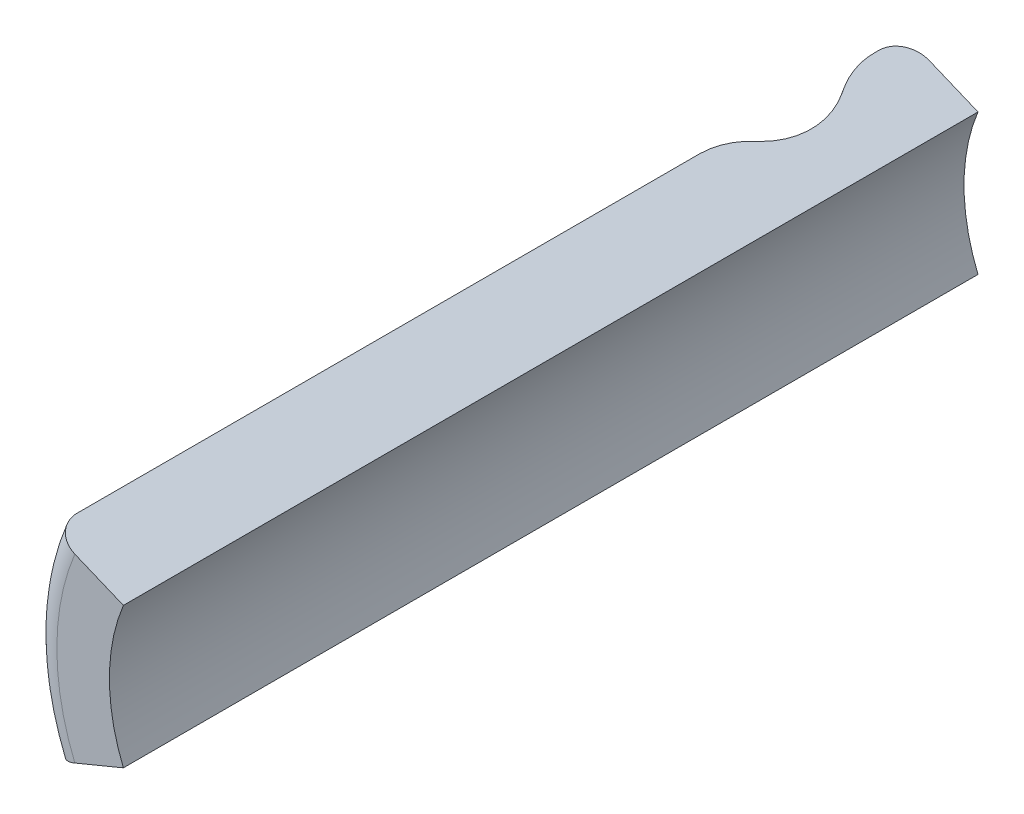
ISO-10303-21;
HEADER;
FILE_DESCRIPTION(('STEP AP214'),'2;1');
FILE_NAME('part.step','',(''),(''),'','','');
FILE_SCHEMA(('AUTOMOTIVE_DESIGN { 1 0 10303 214 1 1 1 1 }'));
ENDSEC;
DATA;
#1=APPLICATION_CONTEXT('core data for automotive mechanical design processes');
#2=APPLICATION_PROTOCOL_DEFINITION('international standard','automotive_design',2000,#1);
#3=PRODUCT_CONTEXT('',#1,'mechanical');
#4=PRODUCT('Part','Part','',(#3));
#5=PRODUCT_RELATED_PRODUCT_CATEGORY('part','',(#4));
#6=PRODUCT_DEFINITION_FORMATION('','',#4);
#7=PRODUCT_DEFINITION_CONTEXT('part definition',#1,'design');
#8=PRODUCT_DEFINITION('design','',#6,#7);
#9=PRODUCT_DEFINITION_SHAPE('','',#8);
#10=(LENGTH_UNIT() NAMED_UNIT(*) SI_UNIT(.MILLI.,.METRE.));
#11=(NAMED_UNIT(*) PLANE_ANGLE_UNIT() SI_UNIT($,.RADIAN.));
#12=(NAMED_UNIT(*) SI_UNIT($,.STERADIAN.) SOLID_ANGLE_UNIT());
#13=UNCERTAINTY_MEASURE_WITH_UNIT(LENGTH_MEASURE(1.E-05),#10,'distance_accuracy_value','');
#14=(GEOMETRIC_REPRESENTATION_CONTEXT(3) GLOBAL_UNCERTAINTY_ASSIGNED_CONTEXT((#13)) GLOBAL_UNIT_ASSIGNED_CONTEXT((#10,
#11,#12)) REPRESENTATION_CONTEXT('',''));
#15=CARTESIAN_POINT('',(0.,0.,0.));
#16=DIRECTION('',(0.,0.,1.));
#17=DIRECTION('',(1.,0.,0.));
#18=AXIS2_PLACEMENT_3D('',#15,#16,#17);
#19=CARTESIAN_POINT('',(0.,0.,0.42));
#20=DIRECTION('',(0.,0.,1.));
#21=DIRECTION('',(1.,0.,0.));
#22=AXIS2_PLACEMENT_3D('',#19,#20,#21);
#23=CYLINDRICAL_SURFACE('',#22,5.25);
#24=DIRECTION('',(0.,0.,1.));
#25=VECTOR('',#24,1.);
#26=CARTESIAN_POINT('',(-4.85036754568425,2.00908801991673,0.42));
#27=LINE('',#26,#25);
#28=CARTESIAN_POINT('',(-4.85036754568425,2.00908801991674,1.03375025520622));
#29=VERTEX_POINT('',#28);
#30=CARTESIAN_POINT('',(-4.85036754568425,2.00908801991674,0.945));
#31=VERTEX_POINT('',#30);
#32=EDGE_CURVE('E102',#29,#31,#27,.F.);
#33=ORIENTED_EDGE('',*,*,#32,.T.);
#34=CARTESIAN_POINT('',(0.,0.,0.945));
#35=DIRECTION('',(0.,0.,1.));
#36=DIRECTION('',(1.,0.,0.));
#37=AXIS2_PLACEMENT_3D('',#34,#35,#36);
#38=CIRCLE('',#37,5.25);
#39=CARTESIAN_POINT('',(-4.85036754568426,-2.00908801991672,0.945));
#40=VERTEX_POINT('',#39);
#41=EDGE_CURVE('E118',#40,#31,#38,.F.);
#42=ORIENTED_EDGE('',*,*,#41,.F.);
#43=DIRECTION('',(0.,0.,1.));
#44=VECTOR('',#43,1.);
#45=CARTESIAN_POINT('',(-4.85036754568425,-2.00908801991673,0.42));
#46=LINE('',#45,#44);
#47=CARTESIAN_POINT('',(-4.85036754568426,-2.00908801991672,1.03375025520622));
#48=VERTEX_POINT('',#47);
#49=EDGE_CURVE('E108',#40,#48,#46,.T.);
#50=ORIENTED_EDGE('',*,*,#49,.T.);
#51=CARTESIAN_POINT('',(0.,0.,1.03375025520622));
#52=DIRECTION('',(0.,0.,-1.));
#53=DIRECTION('',(1.,0.,0.));
#54=AXIS2_PLACEMENT_3D('',#51,#52,#53);
#55=CIRCLE('',#54,5.25);
#56=EDGE_CURVE('E159',#29,#48,#55,.F.);
#57=ORIENTED_EDGE('',*,*,#56,.F.);
#58=EDGE_LOOP('',(#33,#42,#50,#57));
#59=FACE_BOUND('',#58,.T.);
#60=ADVANCED_FACE('F17',(#59),#23,.T.);
#61=CARTESIAN_POINT('',(0.,0.,0.945));
#62=DIRECTION('',(0.,0.,1.));
#63=DIRECTION('',(1.,0.,0.));
#64=AXIS2_PLACEMENT_3D('',#61,#62,#63);
#65=TOROIDAL_SURFACE('',#64,4.725,0.525);
#66=CARTESIAN_POINT('',(-4.85036754568425,2.00908801991674,0.945));
#67=CARTESIAN_POINT('',(-4.85039072116,2.00909761951311,0.915464391405059));
#68=CARTESIAN_POINT('',(-4.84806622229641,2.00813478055809,0.885936277537769));
#69=CARTESIAN_POINT('',(-4.83889289537985,2.00433506413717,0.827737923886833));
#70=CARTESIAN_POINT('',(-4.83204761711793,2.00149965704287,0.799067029448648));
#71=CARTESIAN_POINT('',(-4.81399892411025,1.99402364361598,0.743363719677459));
#72=CARTESIAN_POINT('',(-4.80279341672495,1.98938217048371,0.716332098305047));
#73=CARTESIAN_POINT('',(-4.7763521295304,1.97842983072113,0.664693094464665));
#74=CARTESIAN_POINT('',(-4.7611170597048,1.97211925817567,0.640085285983271));
#75=CARTESIAN_POINT('',(-4.72704476589314,1.95800605197771,0.593985045585102));
#76=CARTESIAN_POINT('',(-4.70820719582775,1.95020327497447,0.572492913329231));
#77=CARTESIAN_POINT('',(-4.66746560106758,1.9333275538721,0.533237078711864));
#78=CARTESIAN_POINT('',(-4.64556162580988,1.92425463025048,0.515473316252535));
#79=CARTESIAN_POINT('',(-4.59930486040363,1.9050944506677,0.484173774991626));
#80=CARTESIAN_POINT('',(-4.57495133392577,1.89500688970896,0.470639272546676));
#81=CARTESIAN_POINT('',(-4.52449545169202,1.87410737898624,0.448194865945521));
#82=CARTESIAN_POINT('',(-4.4983941303668,1.86329585769747,0.43928225317132));
#83=CARTESIAN_POINT('',(-4.45433269969835,1.84504501553704,0.4285495531201));
#84=CARTESIAN_POINT('',(-4.43664976944948,1.83772050600546,0.425345407947885));
#85=CARTESIAN_POINT('',(-4.40109062734294,1.82299142707858,0.421070913483755));
#86=CARTESIAN_POINT('',(-4.38321472577347,1.81558698620886,0.419997539157893));
#87=CARTESIAN_POINT('',(-4.36533079111583,1.80817921792507,0.42));
#88=B_SPLINE_CURVE_WITH_KNOTS('',3,(#66,#67,#68,#69,#70,#71,#72,#73,#74,#75,#76,#77,#78,#79,#80,
#81,#82,#83,#84,#85,#86,#87),.UNSPECIFIED.,.F.,.F.,(4,2,2,2,2,2,2,2,2,2,4),(0.,
0.0884891143575643,0.176908828074504,0.265371030215084,0.353817656241404,0.44227278329125,
0.530726484417661,0.619206854434947,0.707635312539519,0.765743495319773,0.823769123330236),.UNSPECIFIED.);
#89=CARTESIAN_POINT('',(-4.36533079111583,1.80817921792506,0.420000000000001));
#90=VERTEX_POINT('',#89);
#91=EDGE_CURVE('E121',#31,#90,#88,.T.);
#92=ORIENTED_EDGE('',*,*,#91,.T.);
#93=CARTESIAN_POINT('',(0.,0.,0.42));
#94=DIRECTION('',(0.,0.,1.));
#95=DIRECTION('',(-0.923879532511286,0.382683432365091,0.));
#96=AXIS2_PLACEMENT_3D('',#93,#94,#95);
#97=CIRCLE('',#96,4.725);
#98=CARTESIAN_POINT('',(-4.36533079111583,-1.80817921792505,0.420000000000001));
#99=VERTEX_POINT('',#98);
#100=EDGE_CURVE('E125',#90,#99,#97,.T.);
#101=ORIENTED_EDGE('',*,*,#100,.T.);
#102=CARTESIAN_POINT('',(-4.36533079111584,-1.80817921792503,0.42));
#103=CARTESIAN_POINT('',(-4.39261813537697,-1.81948200599914,0.419974915045805));
#104=CARTESIAN_POINT('',(-4.41989855541262,-1.83078192596514,0.42249093448535));
#105=CARTESIAN_POINT('',(-4.47366682317657,-1.85305347169828,0.432420071990568));
#106=CARTESIAN_POINT('',(-4.5001552757268,-1.86402534799086,0.439829347790094));
#107=CARTESIAN_POINT('',(-4.55161842351754,-1.88534208176819,0.459365112327078));
#108=CARTESIAN_POINT('',(-4.57659238523411,-1.89568663541738,0.471493866121253));
#109=CARTESIAN_POINT('',(-4.62430060396151,-1.91544802665093,0.500113709146319));
#110=CARTESIAN_POINT('',(-4.64703525455742,-1.92486502726358,0.51660402989646));
#111=CARTESIAN_POINT('',(-4.68962632310514,-1.942506825492,0.553483614964273));
#112=CARTESIAN_POINT('',(-4.70948246420637,-1.95073150843252,0.573873253875513));
#113=CARTESIAN_POINT('',(-4.745750126341,-1.96575406596425,0.617971638271389));
#114=CARTESIAN_POINT('',(-4.76216170289757,-1.97255196355391,0.641680330245724));
#115=CARTESIAN_POINT('',(-4.79107870844551,-1.98452977943509,0.691748292332198));
#116=CARTESIAN_POINT('',(-4.80358295823713,-1.98970920928607,0.718108359441452));
#117=CARTESIAN_POINT('',(-4.8243188861153,-1.9982983118416,0.772721412830139));
#118=CARTESIAN_POINT('',(-4.83255306663858,-2.00170902108937,0.800973279449886));
#119=CARTESIAN_POINT('',(-4.84246878854448,-2.00581624758352,0.848665028339134));
#120=CARTESIAN_POINT('',(-4.84542903268829,-2.00704242085582,0.867804894118826));
#121=CARTESIAN_POINT('',(-4.84937815063553,-2.00867819906897,0.906293832184033));
#122=CARTESIAN_POINT('',(-4.85036981920592,-2.00908896164021,0.925642568616027));
#123=CARTESIAN_POINT('',(-4.85036754568426,-2.00908801991671,0.944999999999993));
#124=B_SPLINE_CURVE_WITH_KNOTS('',3,(#102,#103,#104,#105,#106,#107,#108,#109,#110,#111,#112,
#113,#114,#115,#116,#117,#118,#119,#120,#121,#122,#123),.UNSPECIFIED.,.F.,.F.,(4,2,2,2,2,2,2,2,
2,2,4),(0.,0.0884891143575647,0.176908828074505,0.265371030215086,0.353817656241405,
0.442272783291251,0.530726484417661,0.619206854434947,0.707635312539521,0.765743495319775,
0.823769123330237),.UNSPECIFIED.);
#125=EDGE_CURVE('E111',#99,#40,#124,.T.);
#126=ORIENTED_EDGE('',*,*,#125,.T.);
#127=ORIENTED_EDGE('',*,*,#41,.T.);
#128=EDGE_LOOP('',(#92,#101,#126,#127));
#129=FACE_BOUND('',#128,.T.);
#130=ADVANCED_FACE('F123',(#129),#65,.T.);
#131=CARTESIAN_POINT('',(0.,0.,1.03375025520622));
#132=DIRECTION('',(0.,0.,-1.));
#133=DIRECTION('',(1.,0.,0.));
#134=AXIS2_PLACEMENT_3D('',#131,#132,#133);
#135=TOROIDAL_SURFACE('',#134,3.675,1.575);
#136=CARTESIAN_POINT('',(-4.64300403924538,1.92319524320852,1.84408106999119));
#137=CARTESIAN_POINT('',(-4.66429309803461,1.93201346008917,1.80567264401998));
#138=CARTESIAN_POINT('',(-4.68405717686005,1.94020000958649,1.76630490990075));
#139=CARTESIAN_POINT('',(-4.72042309677667,1.95526326682412,1.6858823007901));
#140=CARTESIAN_POINT('',(-4.73702417511881,1.96213965862346,1.64482702174626));
#141=CARTESIAN_POINT('',(-4.7812053319323,1.98044009297694,1.52144596810938));
#142=CARTESIAN_POINT('',(-4.80415967611241,1.98994809365172,1.43709672179313));
#143=CARTESIAN_POINT('',(-4.83034396301637,2.00079398040841,1.29949087476993));
#144=CARTESIAN_POINT('',(-4.83778357186358,2.00387556729167,1.24711280321494));
#145=CARTESIAN_POINT('',(-4.84782961323938,2.00803677387769,1.14108991509352));
#146=CARTESIAN_POINT('',(-4.85036834746839,2.00908835202661,1.0874375779001));
#147=CARTESIAN_POINT('',(-4.85036754568425,2.00908801991674,1.03375025520622));
#148=B_SPLINE_CURVE_WITH_KNOTS('',3,(#136,#137,#138,#139,#140,#141,#142,#143,#144,#145,#146,
#147),.UNSPECIFIED.,.F.,.F.,(4,2,2,2,2,4),(0.,0.134277866281093,0.268588072437484,
0.530970445713373,0.689715228991273,0.850637571574639),.UNSPECIFIED.);
#149=CARTESIAN_POINT('',(-4.64300403923459,1.92319524320823,1.8440810699835));
#150=VERTEX_POINT('',#149);
#151=EDGE_CURVE('E166',#150,#29,#148,.T.);
#152=ORIENTED_EDGE('',*,*,#151,.T.);
#153=ORIENTED_EDGE('',*,*,#56,.T.);
#154=CARTESIAN_POINT('',(-4.85036754568426,-2.0090880199167,1.03375025520622));
#155=CARTESIAN_POINT('',(-4.85036600529361,-2.00908738186601,1.07854079166083));
#156=CARTESIAN_POINT('',(-4.84860081541753,-2.00835621627917,1.1233046877799));
#157=CARTESIAN_POINT('',(-4.8415568869684,-2.00543852558316,1.21251818484822));
#158=CARTESIAN_POINT('',(-4.83627730228437,-2.00325165000333,1.25696770750516));
#159=CARTESIAN_POINT('',(-4.81551535662384,-1.99465177052949,1.38736996437549));
#160=CARTESIAN_POINT('',(-4.79510464015692,-1.98619737495114,1.4724818037188));
#161=CARTESIAN_POINT('',(-4.75214900498003,-1.96840456828052,1.60505951192238));
#162=CARTESIAN_POINT('',(-4.73363143829542,-1.96073434101761,1.65411635318998));
#163=CARTESIAN_POINT('',(-4.69184976586033,-1.94342780563636,1.75062473145222));
#164=CARTESIAN_POINT('',(-4.66852403450147,-1.93376597135525,1.79804501708299));
#165=CARTESIAN_POINT('',(-4.64300403924539,-1.92319524320849,1.84408106999119));
#166=B_SPLINE_CURVE_WITH_KNOTS('',3,(#154,#155,#156,#157,#158,#159,#160,#161,#162,#163,#164,
#165),.UNSPECIFIED.,.F.,.F.,(4,2,2,2,2,4),(0.,0.134277866281094,0.268588072437484,
0.530970445713373,0.689715228991272,0.850637571574638),.UNSPECIFIED.);
#167=CARTESIAN_POINT('',(-4.64300403923459,-1.92319524320821,1.8440810699835));
#168=VERTEX_POINT('',#167);
#169=EDGE_CURVE('E114',#48,#168,#166,.T.);
#170=ORIENTED_EDGE('',*,*,#169,.T.);
#171=CARTESIAN_POINT('',(0.,0.,1.8440810699758));
#172=DIRECTION('',(0.,0.,-1.));
#173=DIRECTION('',(-1.,0.,0.));
#174=AXIS2_PLACEMENT_3D('',#171,#172,#173);
#175=CIRCLE('',#174,5.02555135801686);
#176=EDGE_CURVE('E155',#150,#168,#175,.F.);
#177=ORIENTED_EDGE('',*,*,#176,.F.);
#178=EDGE_LOOP('',(#152,#153,#170,#177));
#179=FACE_BOUND('',#178,.T.);
#180=ADVANCED_FACE('F146',(#179),#135,.T.);
#181=CARTESIAN_POINT('',(0.,0.,0.42));
#182=DIRECTION('',(0.,0.,1.));
#183=DIRECTION('',(1.,0.,0.));
#184=AXIS2_PLACEMENT_3D('',#181,#182,#183);
#185=PLANE('',#184);
#186=ORIENTED_EDGE('',*,*,#100,.F.);
#187=DIRECTION('',(-0.923879532511288,0.382683432365087,0.));
#188=VECTOR('',#187,1.);
#189=CARTESIAN_POINT('',(-3.39525728197898,1.40636161394171,0.42));
#190=LINE('',#189,#188);
#191=CARTESIAN_POINT('',(-3.39525728197898,1.40636161394172,0.420000000000001));
#192=VERTEX_POINT('',#191);
#193=EDGE_CURVE('E165',#192,#90,#190,.T.);
#194=ORIENTED_EDGE('',*,*,#193,.F.);
#195=CARTESIAN_POINT('',(0.,0.,0.420000000000001));
#196=DIRECTION('',(0.,0.,1.));
#197=DIRECTION('',(1.,0.,0.));
#198=AXIS2_PLACEMENT_3D('',#195,#196,#197);
#199=CIRCLE('',#198,3.675);
#200=CARTESIAN_POINT('',(-3.39525728197898,-1.4063616139417,0.420000000000001));
#201=VERTEX_POINT('',#200);
#202=EDGE_CURVE('E287',#192,#201,#199,.T.);
#203=ORIENTED_EDGE('',*,*,#202,.T.);
#204=DIRECTION('',(0.923879532511288,0.382683432365087,0.));
#205=VECTOR('',#204,1.);
#206=CARTESIAN_POINT('',(-4.36533079111583,-1.80817921792505,0.42));
#207=LINE('',#206,#205);
#208=EDGE_CURVE('E241',#99,#201,#207,.T.);
#209=ORIENTED_EDGE('',*,*,#208,.F.);
#210=EDGE_LOOP('',(#186,#194,#203,#209));
#211=FACE_BOUND('',#210,.T.);
#212=ADVANCED_FACE('F250',(#211),#185,.F.);
#213=CARTESIAN_POINT('',(0.,0.,1.8440810699758));
#214=DIRECTION('',(0.,0.,-1.));
#215=DIRECTION('',(-1.,0.,0.));
#216=AXIS2_PLACEMENT_3D('',#213,#214,#215);
#217=CONICAL_SURFACE('',#216,5.02555135801686,0.540419500335847);
#218=DIRECTION('',(0.475332098003424,-0.196889001624276,0.857492925712544));
#219=VECTOR('',#218,1.);
#220=CARTESIAN_POINT('',(-276615.197263172,114577.766264916,-499000.));
#221=LINE('',#220,#219);
#222=CARTESIAN_POINT('',(-4.57200124642326,1.89378492346583,1.97216918519791));
#223=VERTEX_POINT('',#222);
#224=EDGE_CURVE('E240',#223,#150,#221,.F.);
#225=ORIENTED_EDGE('',*,*,#224,.T.);
#226=ORIENTED_EDGE('',*,*,#176,.T.);
#227=DIRECTION('',(0.475332098003424,0.196889001624276,0.857492925712544));
#228=VECTOR('',#227,1.);
#229=CARTESIAN_POINT('',(-276615.197263172,-114577.766264915,-499000.));
#230=LINE('',#229,#228);
#231=CARTESIAN_POINT('',(-4.57200124642326,-1.8937849234587,1.97216918519791));
#232=VERTEX_POINT('',#231);
#233=EDGE_CURVE('E238',#168,#232,#230,.T.);
#234=ORIENTED_EDGE('',*,*,#233,.T.);
#235=CARTESIAN_POINT('',(0.,0.,1.97216918520165));
#236=DIRECTION('',(0.,0.,-1.));
#237=DIRECTION('',(1.,0.,0.));
#238=AXIS2_PLACEMENT_3D('',#235,#236,#237);
#239=CIRCLE('',#238,4.94869848887901);
#240=EDGE_CURVE('E307',#232,#223,#239,.T.);
#241=ORIENTED_EDGE('',*,*,#240,.T.);
#242=EDGE_LOOP('',(#225,#226,#234,#241));
#243=FACE_BOUND('',#242,.T.);
#244=ADVANCED_FACE('F259',(#243),#217,.T.);
#245=CARTESIAN_POINT('',(0.,0.,17.5));
#246=DIRECTION('',(0.,0.,1.));
#247=DIRECTION('',(1.,0.,0.));
#248=AXIS2_PLACEMENT_3D('',#245,#246,#247);
#249=PLANE('',#248);
#250=DIRECTION('',(-0.923879532511288,0.382683432365087,0.));
#251=VECTOR('',#250,1.);
#252=CARTESIAN_POINT('',(-3.39525728197898,1.40636161394171,17.5));
#253=LINE('',#252,#251);
#254=CARTESIAN_POINT('',(-3.39525728197898,1.40636161394172,17.5));
#255=VERTEX_POINT('',#254);
#256=CARTESIAN_POINT('',(-4.36533079111583,1.80817921792505,17.5));
#257=VERTEX_POINT('',#256);
#258=EDGE_CURVE('E277',#255,#257,#253,.T.);
#259=ORIENTED_EDGE('',*,*,#258,.T.);
#260=CARTESIAN_POINT('',(0.,0.,17.5));
#261=DIRECTION('',(0.,0.,-1.));
#262=DIRECTION('',(-0.923879532511286,-0.382683432365092,0.));
#263=AXIS2_PLACEMENT_3D('',#260,#261,#262);
#264=CIRCLE('',#263,4.725);
#265=CARTESIAN_POINT('',(-4.36533079111583,-1.80817921792505,17.5));
#266=VERTEX_POINT('',#265);
#267=EDGE_CURVE('E346',#266,#257,#264,.T.);
#268=ORIENTED_EDGE('',*,*,#267,.F.);
#269=DIRECTION('',(-0.923879532511286,-0.382683432365091,0.));
#270=VECTOR('',#269,1.);
#271=CARTESIAN_POINT('',(-14.7629551057445,-6.1150162255045,17.5));
#272=LINE('',#271,#270);
#273=CARTESIAN_POINT('',(-3.39525728197899,-1.40636161394169,17.5));
#274=VERTEX_POINT('',#273);
#275=EDGE_CURVE('E237',#266,#274,#272,.F.);
#276=ORIENTED_EDGE('',*,*,#275,.T.);
#277=CARTESIAN_POINT('',(0.,0.,17.5));
#278=DIRECTION('',(0.,0.,1.));
#279=DIRECTION('',(1.,0.,0.));
#280=AXIS2_PLACEMENT_3D('',#277,#278,#279);
#281=CIRCLE('',#280,3.675);
#282=EDGE_CURVE('E284',#274,#255,#281,.F.);
#283=ORIENTED_EDGE('',*,*,#282,.T.);
#284=EDGE_LOOP('',(#259,#268,#276,#283));
#285=FACE_BOUND('',#284,.T.);
#286=ADVANCED_FACE('F262',(#285),#249,.T.);
#287=CARTESIAN_POINT('',(0.,0.,-5.13241922552691));
#288=DIRECTION('',(0.,0.,1.));
#289=DIRECTION('',(1.,0.,0.));
#290=AXIS2_PLACEMENT_3D('',#287,#288,#289);
#291=CYLINDRICAL_SURFACE('',#290,3.675);
#292=ORIENTED_EDGE('',*,*,#202,.F.);
#293=DIRECTION('',(0.,0.,1.));
#294=VECTOR('',#293,1.);
#295=CARTESIAN_POINT('',(-3.39525728197898,1.40636161394172,-69.0547595456195));
#296=LINE('',#295,#294);
#297=EDGE_CURVE('E352',#192,#255,#296,.T.);
#298=ORIENTED_EDGE('',*,*,#297,.T.);
#299=ORIENTED_EDGE('',*,*,#282,.F.);
#300=DIRECTION('',(0.,0.,1.));
#301=VECTOR('',#300,1.);
#302=CARTESIAN_POINT('',(-3.39525728197899,-1.40636161394169,-69.0547595456195));
#303=LINE('',#302,#301);
#304=EDGE_CURVE('E228',#274,#201,#303,.F.);
#305=ORIENTED_EDGE('',*,*,#304,.T.);
#306=EDGE_LOOP('',(#292,#298,#299,#305));
#307=FACE_BOUND('',#306,.T.);
#308=ADVANCED_FACE('F267',(#307),#291,.F.);
#309=CARTESIAN_POINT('',(0.,0.,2.7825));
#310=DIRECTION('',(0.,0.,-1.));
#311=DIRECTION('',(1.,0.,0.));
#312=AXIS2_PLACEMENT_3D('',#309,#310,#311);
#313=TOROIDAL_SURFACE('',#312,6.29924984687627,1.575);
#314=CARTESIAN_POINT('',(0.,0.,3.59283081479589));
#315=DIRECTION('',(0.,0.,1.));
#316=DIRECTION('',(-1.,0.,0.));
#317=AXIS2_PLACEMENT_3D('',#314,#315,#316);
#318=CIRCLE('',#317,4.94869848887447);
#319=CARTESIAN_POINT('',(-4.57200124644275,1.8937849234633,3.59283081479712));
#320=VERTEX_POINT('',#319);
#321=CARTESIAN_POINT('',(-4.57200124644391,-1.89378492346374,3.59283081479665));
#322=VERTEX_POINT('',#321);
#323=EDGE_CURVE('E314',#320,#322,#318,.T.);
#324=ORIENTED_EDGE('',*,*,#323,.F.);
#325=CARTESIAN_POINT('',(-4.57200124644432,1.89378492346395,3.5928308147974));
#326=CARTESIAN_POINT('',(-4.55093515448217,1.88505906246703,3.55482724904515));
#327=CARTESIAN_POINT('',(-4.53136157275591,1.8769514194518,3.51587916441505));
#328=CARTESIAN_POINT('',(-4.49531475325361,1.86202033793353,3.43633928581823));
#329=CARTESIAN_POINT('',(-4.47884136811824,1.85519683839226,3.39574757008851));
#330=CARTESIAN_POINT('',(-4.43430005042164,1.83674722051636,3.27203149845141));
#331=CARTESIAN_POINT('',(-4.41102736952862,1.8271073604577,3.18681508065259));
#332=CARTESIAN_POINT('',(-4.37802955209979,1.81343921694996,3.01337536711703));
#333=CARTESIAN_POINT('',(-4.36830948583724,1.80941303367685,2.92515095867636));
#334=CARTESIAN_POINT('',(-4.36268631730648,1.8070838410079,2.74814278282857));
#335=CARTESIAN_POINT('',(-4.36678806541627,1.80878284070441,2.65935882997643));
#336=CARTESIAN_POINT('',(-4.38870850344873,1.81786258343062,2.4837431147338));
#337=CARTESIAN_POINT('',(-4.40653744544026,1.82524757300627,2.39691286135823));
#338=CARTESIAN_POINT('',(-4.45540445468333,1.84548895098736,2.22785223157007));
#339=CARTESIAN_POINT('',(-4.48641809571375,1.85833522172073,2.14561366566707));
#340=CARTESIAN_POINT('',(-4.53868306572915,1.87998408113813,2.03467500151676));
#341=CARTESIAN_POINT('',(-4.55485093830133,1.88668103323225,2.00309135114615));
#342=CARTESIAN_POINT('',(-4.57200124644325,1.89378492346351,1.97216918520453));
#343=B_SPLINE_CURVE_WITH_KNOTS('',3,(#325,#326,#327,#328,#329,#330,#331,#332,#333,#334,#335,
#336,#337,#338,#339,#340,#341,#342),.UNSPECIFIED.,.F.,.F.,(4,2,2,2,2,2,2,2,4),(0.,
0.132875919697835,0.265745521907456,0.530963010608872,0.796279695273054,1.06168949507938,
1.32729770703766,1.5924159779919,1.70064738321001),.UNSPECIFIED.);
#344=EDGE_CURVE('E193',#320,#223,#343,.T.);
#345=ORIENTED_EDGE('',*,*,#344,.T.);
#346=ORIENTED_EDGE('',*,*,#240,.F.);
#347=CARTESIAN_POINT('',(-4.57200124644293,-1.89378492346333,1.97216918520513));
#348=CARTESIAN_POINT('',(-4.55093515448085,-1.88505906246644,2.01017275095742));
#349=CARTESIAN_POINT('',(-4.53136157275465,-1.87695141945123,2.04912083558757));
#350=CARTESIAN_POINT('',(-4.49531475325249,-1.86202033793303,2.12866071418446));
#351=CARTESIAN_POINT('',(-4.47884136811719,-1.85519683839179,2.16925242991421));
#352=CARTESIAN_POINT('',(-4.4343000504208,-1.83674722051598,2.29296850155141));
#353=CARTESIAN_POINT('',(-4.41102736952794,-1.82710736045737,2.37818491935027));
#354=CARTESIAN_POINT('',(-4.3780295520994,-1.81343921694976,2.55162463288591));
#355=CARTESIAN_POINT('',(-4.36830948583701,-1.80941303367671,2.63984904132659));
#356=CARTESIAN_POINT('',(-4.36268631730655,-1.80708384100789,2.81685721717439));
#357=CARTESIAN_POINT('',(-4.3667880654165,-1.80878284070446,2.90564117002653));
#358=CARTESIAN_POINT('',(-4.38870850344926,-1.81786258343079,3.08125688526911));
#359=CARTESIAN_POINT('',(-4.40653744544094,-1.82524757300651,3.16808713864464));
#360=CARTESIAN_POINT('',(-4.45540445468431,-1.84548895098772,3.33714776843271));
#361=CARTESIAN_POINT('',(-4.48641809571487,-1.85833522172116,3.41938633433564));
#362=CARTESIAN_POINT('',(-4.53868306573036,-1.8799840811386,3.53032499848564));
#363=CARTESIAN_POINT('',(-4.55485093830248,-1.88668103323269,3.56190864885601));
#364=CARTESIAN_POINT('',(-4.57200124644433,-1.89378492346392,3.5928308147974));
#365=B_SPLINE_CURVE_WITH_KNOTS('',3,(#347,#348,#349,#350,#351,#352,#353,#354,#355,#356,#357,
#358,#359,#360,#361,#362,#363,#364),.UNSPECIFIED.,.F.,.F.,(4,2,2,2,2,2,2,2,4),(0.,
0.132875919697836,0.265745521907457,0.530963010608873,0.796279695273056,1.06168949507938,
1.32729770703766,1.59241597799191,1.70064738320931),.UNSPECIFIED.);
#366=EDGE_CURVE('E308',#232,#322,#365,.T.);
#367=ORIENTED_EDGE('',*,*,#366,.T.);
#368=EDGE_LOOP('',(#324,#345,#346,#367));
#369=FACE_BOUND('',#368,.T.);
#370=ADVANCED_FACE('F320',(#369),#313,.F.);
#371=CARTESIAN_POINT('',(0.,0.,3.72091893001425));
#372=DIRECTION('',(0.,0.,1.));
#373=DIRECTION('',(0.,-1.,0.));
#374=AXIS2_PLACEMENT_3D('',#371,#372,#373);
#375=CONICAL_SURFACE('',#374,5.02555135801686,0.540419500335847);
#376=DIRECTION('',(0.475332098003445,-0.196889001624286,-0.85749292571253));
#377=VECTOR('',#376,1.);
#378=CARTESIAN_POINT('',(-4.64300403923796,1.92319524320545,3.72091892999543));
#379=LINE('',#378,#377);
#380=CARTESIAN_POINT('',(-4.64300403923796,1.92319524320545,3.72091892999543));
#381=VERTEX_POINT('',#380);
#382=EDGE_CURVE('E190',#381,#320,#379,.T.);
#383=ORIENTED_EDGE('',*,*,#382,.T.);
#384=ORIENTED_EDGE('',*,*,#323,.T.);
#385=DIRECTION('',(-0.475332098003462,-0.196889001624295,0.857492925712519));
#386=VECTOR('',#385,1.);
#387=CARTESIAN_POINT('',(-4.57200124644486,-1.89378492346414,3.59283081479836));
#388=LINE('',#387,#386);
#389=CARTESIAN_POINT('',(-4.64300403923798,-1.92319524320541,3.72091892999543));
#390=VERTEX_POINT('',#389);
#391=EDGE_CURVE('E313',#322,#390,#388,.T.);
#392=ORIENTED_EDGE('',*,*,#391,.T.);
#393=CARTESIAN_POINT('',(0.,0.,3.72091892999543));
#394=DIRECTION('',(0.,0.,1.));
#395=DIRECTION('',(1.,0.,0.));
#396=AXIS2_PLACEMENT_3D('',#393,#394,#395);
#397=CIRCLE('',#396,5.02555135799726);
#398=EDGE_CURVE('E173',#381,#390,#397,.T.);
#399=ORIENTED_EDGE('',*,*,#398,.F.);
#400=EDGE_LOOP('',(#383,#384,#392,#399));
#401=FACE_BOUND('',#400,.T.);
#402=ADVANCED_FACE('F324',(#401),#375,.T.);
#403=CARTESIAN_POINT('',(-14.7629551057445,-6.1150162255045,-69.0547595456195));
#404=DIRECTION('',(-0.382683432365091,0.923879532511286,0.));
#405=DIRECTION('',(-0.923879532511286,-0.382683432365091,0.));
#406=AXIS2_PLACEMENT_3D('',#403,#404,#405);
#407=PLANE('',#406);
#408=ORIENTED_EDGE('',*,*,#208,.T.);
#409=ORIENTED_EDGE('',*,*,#304,.F.);
#410=ORIENTED_EDGE('',*,*,#275,.F.);
#411=CARTESIAN_POINT('',(-4.85036754568426,-2.0090880199167,16.975));
#412=CARTESIAN_POINT('',(-4.85039072116002,-2.00909761951308,17.0045356085949));
#413=CARTESIAN_POINT('',(-4.84806622229642,-2.00813478055805,17.0340637224622));
#414=CARTESIAN_POINT('',(-4.83889289537986,-2.00433506413713,17.0922620761132));
#415=CARTESIAN_POINT('',(-4.83204761711795,-2.00149965704283,17.1209329705514));
#416=CARTESIAN_POINT('',(-4.81399892411027,-1.99402364361594,17.1766362803225));
#417=CARTESIAN_POINT('',(-4.80279341672496,-1.98938217048367,17.203667901695));
#418=CARTESIAN_POINT('',(-4.77635212953042,-1.97842983072109,17.2553069055353));
#419=CARTESIAN_POINT('',(-4.76111705970481,-1.97211925817563,17.2799147140167));
#420=CARTESIAN_POINT('',(-4.72704476589315,-1.95800605197768,17.3260149544149));
#421=CARTESIAN_POINT('',(-4.70820719582776,-1.95020327497444,17.3475070866708));
#422=CARTESIAN_POINT('',(-4.6674656010676,-1.93332755387207,17.3867629212881));
#423=CARTESIAN_POINT('',(-4.64556162580989,-1.92425463025044,17.4045266837475));
#424=CARTESIAN_POINT('',(-4.59930486040365,-1.90509445066767,17.4358262250084));
#425=CARTESIAN_POINT('',(-4.57495133392579,-1.89500688970893,17.4493607274533));
#426=CARTESIAN_POINT('',(-4.52449545169203,-1.8741073789862,17.4718051340545));
#427=CARTESIAN_POINT('',(-4.49839413036681,-1.86329585769743,17.4807177468287));
#428=CARTESIAN_POINT('',(-4.45433269969837,-1.845045015537,17.4914504468799));
#429=CARTESIAN_POINT('',(-4.4366497694495,-1.83772050600543,17.4946545920521));
#430=CARTESIAN_POINT('',(-4.40109062734296,-1.82299142707855,17.4989290865162));
#431=CARTESIAN_POINT('',(-4.38321472577348,-1.81558698620883,17.5000024608421));
#432=CARTESIAN_POINT('',(-4.36533079111584,-1.80817921792503,17.5));
#433=B_SPLINE_CURVE_WITH_KNOTS('',3,(#411,#412,#413,#414,#415,#416,#417,#418,#419,#420,#421,
#422,#423,#424,#425,#426,#427,#428,#429,#430,#431,#432),.UNSPECIFIED.,.F.,.F.,(4,2,2,2,2,2,2,2,
2,2,4),(0.,0.0884891143575647,0.176908828074501,0.265371030215083,0.3538176562414,
0.442272783291245,0.530726484417658,0.619206854434945,0.707635312539516,0.765743495319769,
0.823769123330232),.UNSPECIFIED.);
#434=CARTESIAN_POINT('',(-4.85036754568426,-2.00908801991672,16.975));
#435=VERTEX_POINT('',#434);
#436=EDGE_CURVE('E236',#435,#266,#433,.T.);
#437=ORIENTED_EDGE('',*,*,#436,.F.);
#438=DIRECTION('',(0.,0.,1.));
#439=VECTOR('',#438,1.);
#440=CARTESIAN_POINT('',(-4.85036754568425,-2.00908801991673,4.095));
#441=LINE('',#440,#439);
#442=CARTESIAN_POINT('',(-4.85036754568426,-2.00908801991672,4.53124974479378));
#443=VERTEX_POINT('',#442);
#444=EDGE_CURVE('E198',#443,#435,#441,.T.);
#445=ORIENTED_EDGE('',*,*,#444,.F.);
#446=CARTESIAN_POINT('',(-4.64300403923798,-1.92319524320541,3.72091892999543));
#447=CARTESIAN_POINT('',(-4.66429309802756,-1.93201346008622,3.75932735596642));
#448=CARTESIAN_POINT('',(-4.68405717685337,-1.94020000958368,3.79869509008545));
#449=CARTESIAN_POINT('',(-4.72042309677074,-1.95526326682163,3.87911769919573));
#450=CARTESIAN_POINT('',(-4.73702417511325,-1.96213965862111,3.9201729782394));
#451=CARTESIAN_POINT('',(-4.78120533192787,-1.98044009297506,4.04355403187579));
#452=CARTESIAN_POINT('',(-4.80415967610874,-1.98994809365016,4.12790327819178));
#453=CARTESIAN_POINT('',(-4.83034396301443,-2.00079398040756,4.26550912521719));
#454=CARTESIAN_POINT('',(-4.83778357186236,-2.00387556729113,4.31788719677466));
#455=CARTESIAN_POINT('',(-4.84782961323914,-2.00803677387755,4.42391008490119));
#456=CARTESIAN_POINT('',(-4.85036834746841,-2.00908835202657,4.47756242209726));
#457=CARTESIAN_POINT('',(-4.85036754568426,-2.00908801991671,4.53124974479377));
#458=B_SPLINE_CURVE_WITH_KNOTS('',3,(#446,#447,#448,#449,#450,#451,#452,#453,#454,#455,#456,
#457),.UNSPECIFIED.,.F.,.F.,(4,2,2,2,2,4),(0.,0.134277866281122,0.268588072437538,
0.530970445713373,0.689715228998934,0.850637571590215),.UNSPECIFIED.);
#459=EDGE_CURVE('E174',#390,#443,#458,.T.);
#460=ORIENTED_EDGE('',*,*,#459,.F.);
#461=ORIENTED_EDGE('',*,*,#391,.F.);
#462=ORIENTED_EDGE('',*,*,#366,.F.);
#463=ORIENTED_EDGE('',*,*,#233,.F.);
#464=ORIENTED_EDGE('',*,*,#169,.F.);
#465=ORIENTED_EDGE('',*,*,#49,.F.);
#466=ORIENTED_EDGE('',*,*,#125,.F.);
#467=EDGE_LOOP('',(#408,#409,#410,#437,#445,#460,#461,#462,#463,#464,#465,#466));
#468=FACE_BOUND('',#467,.T.);
#469=ADVANCED_FACE('F109',(#468),#407,.F.);
#470=CARTESIAN_POINT('',(0.,0.,16.975));
#471=DIRECTION('',(0.,0.,-1.));
#472=DIRECTION('',(1.,0.,0.));
#473=AXIS2_PLACEMENT_3D('',#470,#471,#472);
#474=TOROIDAL_SURFACE('',#473,4.725,0.525);
#475=CARTESIAN_POINT('',(-4.36533079111583,1.80817921792507,17.5));
#476=CARTESIAN_POINT('',(-4.39261813537696,1.81948200599917,17.5000250849542));
#477=CARTESIAN_POINT('',(-4.41989855541261,1.83078192596517,17.4975090655146));
#478=CARTESIAN_POINT('',(-4.47366682317656,1.85305347169831,17.4875799280094));
#479=CARTESIAN_POINT('',(-4.50015527572679,1.8640253479909,17.4801706522099));
#480=CARTESIAN_POINT('',(-4.55161842351753,1.88534208176823,17.4606348876729));
#481=CARTESIAN_POINT('',(-4.57659238523409,1.89568663541742,17.4485061338787));
#482=CARTESIAN_POINT('',(-4.62430060396149,1.91544802665097,17.4198862908537));
#483=CARTESIAN_POINT('',(-4.64703525455741,1.92486502726361,17.4033959701035));
#484=CARTESIAN_POINT('',(-4.68962632310513,1.94250682549204,17.3665163850357));
#485=CARTESIAN_POINT('',(-4.70948246420635,1.95073150843256,17.3461267461245));
#486=CARTESIAN_POINT('',(-4.74575012634099,1.96575406596429,17.3020283617286));
#487=CARTESIAN_POINT('',(-4.76216170289755,1.97255196355394,17.2783196697543));
#488=CARTESIAN_POINT('',(-4.7910787084455,1.98452977943512,17.2282517076678));
#489=CARTESIAN_POINT('',(-4.80358295823711,1.98970920928611,17.2018916405586));
#490=CARTESIAN_POINT('',(-4.82431888611528,1.99829831184163,17.1472785871699));
#491=CARTESIAN_POINT('',(-4.83255306663856,2.00170902108941,17.1190267205501));
#492=CARTESIAN_POINT('',(-4.84246878854447,2.00581624758355,17.0713349716609));
#493=CARTESIAN_POINT('',(-4.84542903268827,2.00704242085585,17.0521951058812));
#494=CARTESIAN_POINT('',(-4.84937815063552,2.00867819906901,17.013706167816));
#495=CARTESIAN_POINT('',(-4.8503698192059,2.00908896164024,16.994357431384));
#496=CARTESIAN_POINT('',(-4.85036754568425,2.00908801991674,16.975));
#497=B_SPLINE_CURVE_WITH_KNOTS('',3,(#475,#476,#477,#478,#479,#480,#481,#482,#483,#484,#485,
#486,#487,#488,#489,#490,#491,#492,#493,#494,#495,#496),.UNSPECIFIED.,.F.,.F.,(4,2,2,2,2,2,2,2,
2,2,4),(0.,0.0884891143575641,0.176908828074503,0.265371030215083,0.353817656241402,
0.442272783291246,0.530726484417657,0.619206854434941,0.707635312539516,0.76574349531977,
0.823769123330229),.UNSPECIFIED.);
#498=CARTESIAN_POINT('',(-4.85036754568425,2.00908801991674,16.975));
#499=VERTEX_POINT('',#498);
#500=EDGE_CURVE('E194',#257,#499,#497,.T.);
#501=ORIENTED_EDGE('',*,*,#500,.T.);
#502=CARTESIAN_POINT('',(0.,0.,16.975));
#503=DIRECTION('',(0.,0.,1.));
#504=DIRECTION('',(1.,0.,0.));
#505=AXIS2_PLACEMENT_3D('',#502,#503,#504);
#506=CIRCLE('',#505,5.25);
#507=EDGE_CURVE('E195',#435,#499,#506,.F.);
#508=ORIENTED_EDGE('',*,*,#507,.F.);
#509=ORIENTED_EDGE('',*,*,#436,.T.);
#510=ORIENTED_EDGE('',*,*,#267,.T.);
#511=EDGE_LOOP('',(#501,#508,#509,#510));
#512=FACE_BOUND('',#511,.T.);
#513=ADVANCED_FACE('F204',(#512),#474,.T.);
#514=CARTESIAN_POINT('',(-14.7629551057444,6.1150162255045,-69.0547595456195));
#515=DIRECTION('',(-0.382683432365091,-0.923879532511286,0.));
#516=DIRECTION('',(0.923879532511286,-0.382683432365091,0.));
#517=AXIS2_PLACEMENT_3D('',#514,#515,#516);
#518=PLANE('',#517);
#519=ORIENTED_EDGE('',*,*,#32,.F.);
#520=ORIENTED_EDGE('',*,*,#151,.F.);
#521=ORIENTED_EDGE('',*,*,#224,.F.);
#522=ORIENTED_EDGE('',*,*,#344,.F.);
#523=ORIENTED_EDGE('',*,*,#382,.F.);
#524=CARTESIAN_POINT('',(-4.85036754568425,2.00908801991674,4.53124974479378));
#525=CARTESIAN_POINT('',(-4.85036600529359,2.00908738186604,4.48645920833916));
#526=CARTESIAN_POINT('',(-4.84860081541751,2.00835621627921,4.44169531222008));
#527=CARTESIAN_POINT('',(-4.84155688696838,2.00543852558319,4.35248181515174));
#528=CARTESIAN_POINT('',(-4.83627730228435,2.00325165000336,4.30803229249479));
#529=CARTESIAN_POINT('',(-4.81551535662382,1.99465177052952,4.17763003562447));
#530=CARTESIAN_POINT('',(-4.7951046401569,1.98619737495117,4.09251819628118));
#531=CARTESIAN_POINT('',(-4.75214900497923,1.96840456828023,3.95994048807521));
#532=CARTESIAN_POINT('',(-4.73363143829362,1.9607343410169,3.91088364680528));
#533=CARTESIAN_POINT('',(-4.69184976585606,1.94342780563463,3.81437526853855));
#534=CARTESIAN_POINT('',(-4.66852403449572,1.93376597135291,3.76695498290563));
#535=CARTESIAN_POINT('',(-4.64300403923797,1.92319524320545,3.72091892999544));
#536=B_SPLINE_CURVE_WITH_KNOTS('',3,(#524,#525,#526,#527,#528,#529,#530,#531,#532,#533,#534,
#535),.UNSPECIFIED.,.F.,.F.,(4,2,2,2,2,4),(0.,0.134277866281122,0.268588072437538,
0.530970445713373,0.689715228998935,0.850637571590215),.UNSPECIFIED.);
#537=CARTESIAN_POINT('',(-4.85036754568425,2.00908801991674,4.53124974479378));
#538=VERTEX_POINT('',#537);
#539=EDGE_CURVE('E40',#538,#381,#536,.T.);
#540=ORIENTED_EDGE('',*,*,#539,.F.);
#541=DIRECTION('',(0.,0.,1.));
#542=VECTOR('',#541,1.);
#543=CARTESIAN_POINT('',(-4.85036754568425,2.00908801991673,4.095));
#544=LINE('',#543,#542);
#545=EDGE_CURVE('E31',#499,#538,#544,.F.);
#546=ORIENTED_EDGE('',*,*,#545,.F.);
#547=ORIENTED_EDGE('',*,*,#500,.F.);
#548=ORIENTED_EDGE('',*,*,#258,.F.);
#549=ORIENTED_EDGE('',*,*,#297,.F.);
#550=ORIENTED_EDGE('',*,*,#193,.T.);
#551=ORIENTED_EDGE('',*,*,#91,.F.);
#552=EDGE_LOOP('',(#519,#520,#521,#522,#523,#540,#546,#547,#548,#549,#550,#551));
#553=FACE_BOUND('',#552,.T.);
#554=ADVANCED_FACE('F138',(#553),#518,.F.);
#555=CARTESIAN_POINT('',(0.,0.,4.53124974479378));
#556=DIRECTION('',(0.,0.,1.));
#557=DIRECTION('',(1.,0.,0.));
#558=AXIS2_PLACEMENT_3D('',#555,#556,#557);
#559=TOROIDAL_SURFACE('',#558,3.675,1.575);
#560=ORIENTED_EDGE('',*,*,#539,.T.);
#561=ORIENTED_EDGE('',*,*,#398,.T.);
#562=ORIENTED_EDGE('',*,*,#459,.T.);
#563=CARTESIAN_POINT('',(0.,0.,4.53124974479378));
#564=DIRECTION('',(0.,0.,1.));
#565=DIRECTION('',(1.,0.,0.));
#566=AXIS2_PLACEMENT_3D('',#563,#564,#565);
#567=CIRCLE('',#566,5.25);
#568=EDGE_CURVE('E11',#538,#443,#567,.T.);
#569=ORIENTED_EDGE('',*,*,#568,.F.);
#570=EDGE_LOOP('',(#560,#561,#562,#569));
#571=FACE_BOUND('',#570,.T.);
#572=ADVANCED_FACE('F180',(#571),#559,.T.);
#573=CARTESIAN_POINT('',(0.,0.,4.095));
#574=DIRECTION('',(0.,0.,1.));
#575=DIRECTION('',(1.,0.,0.));
#576=AXIS2_PLACEMENT_3D('',#573,#574,#575);
#577=CYLINDRICAL_SURFACE('',#576,5.25);
#578=ORIENTED_EDGE('',*,*,#545,.T.);
#579=ORIENTED_EDGE('',*,*,#568,.T.);
#580=ORIENTED_EDGE('',*,*,#444,.T.);
#581=ORIENTED_EDGE('',*,*,#507,.T.);
#582=EDGE_LOOP('',(#578,#579,#580,#581));
#583=FACE_BOUND('',#582,.T.);
#584=ADVANCED_FACE('F185',(#583),#577,.T.);
#585=CLOSED_SHELL('',(#60,#130,#180,#212,#244,#286,#308,#370,#402,#469,#513,#554,#572,#584));
#586=MANIFOLD_SOLID_BREP('B1',#585);
#587=ADVANCED_BREP_SHAPE_REPRESENTATION('',(#18,#586),#14);
#588=SHAPE_DEFINITION_REPRESENTATION(#9,#587);
ENDSEC;
END-ISO-10303-21;
